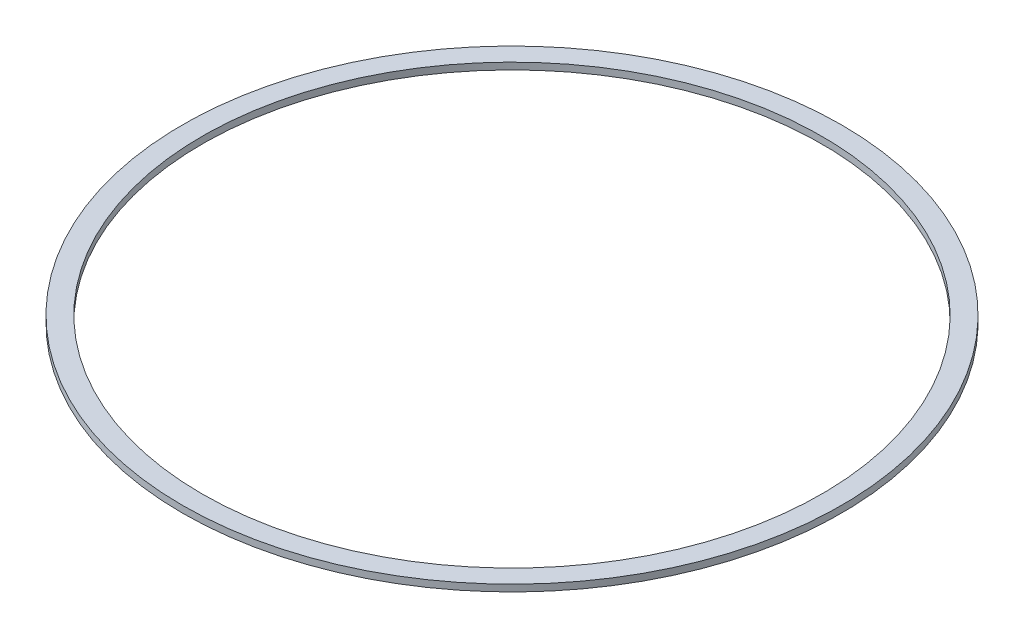
ISO-10303-21;
HEADER;
FILE_DESCRIPTION(('STEP AP214'),'2;1');
FILE_NAME('part.step','',(''),(''),'','','');
FILE_SCHEMA(('AUTOMOTIVE_DESIGN { 1 0 10303 214 1 1 1 1 }'));
ENDSEC;
DATA;
#1=APPLICATION_CONTEXT('core data for automotive mechanical design processes');
#2=APPLICATION_PROTOCOL_DEFINITION('international standard','automotive_design',2000,#1);
#3=PRODUCT_CONTEXT('',#1,'mechanical');
#4=PRODUCT('Part','Part','',(#3));
#5=PRODUCT_RELATED_PRODUCT_CATEGORY('part','',(#4));
#6=PRODUCT_DEFINITION_FORMATION('','',#4);
#7=PRODUCT_DEFINITION_CONTEXT('part definition',#1,'design');
#8=PRODUCT_DEFINITION('design','',#6,#7);
#9=PRODUCT_DEFINITION_SHAPE('','',#8);
#10=(LENGTH_UNIT() NAMED_UNIT(*) SI_UNIT(.MILLI.,.METRE.));
#11=(NAMED_UNIT(*) PLANE_ANGLE_UNIT() SI_UNIT($,.RADIAN.));
#12=(NAMED_UNIT(*) SI_UNIT($,.STERADIAN.) SOLID_ANGLE_UNIT());
#13=UNCERTAINTY_MEASURE_WITH_UNIT(LENGTH_MEASURE(1.E-05),#10,'distance_accuracy_value','');
#14=(GEOMETRIC_REPRESENTATION_CONTEXT(3) GLOBAL_UNCERTAINTY_ASSIGNED_CONTEXT((#13)) GLOBAL_UNIT_ASSIGNED_CONTEXT((#10,
#11,#12)) REPRESENTATION_CONTEXT('',''));
#15=CARTESIAN_POINT('',(0.,0.,0.));
#16=DIRECTION('',(0.,0.,1.));
#17=DIRECTION('',(1.,0.,0.));
#18=AXIS2_PLACEMENT_3D('',#15,#16,#17);
#19=CARTESIAN_POINT('',(0.,0.6,0.));
#20=DIRECTION('',(0.,1.,0.));
#21=DIRECTION('',(0.,0.,1.));
#22=AXIS2_PLACEMENT_3D('',#19,#20,#21);
#23=PLANE('',#22);
#24=CARTESIAN_POINT('',(0.,0.6,0.));
#25=DIRECTION('',(0.,1.,0.));
#26=DIRECTION('',(0.,0.,1.));
#27=AXIS2_PLACEMENT_3D('',#24,#25,#26);
#28=CIRCLE('',#27,29.25);
#29=CARTESIAN_POINT('',(0.,0.6,29.25));
#30=VERTEX_POINT('',#29);
#31=EDGE_CURVE('E10',#30,#30,#28,.T.);
#32=ORIENTED_EDGE('',*,*,#31,.T.);
#33=EDGE_LOOP('',(#32));
#34=FACE_BOUND('',#33,.T.);
#35=CARTESIAN_POINT('',(0.,0.6,0.));
#36=DIRECTION('',(0.,1.,0.));
#37=DIRECTION('',(0.,0.,1.));
#38=AXIS2_PLACEMENT_3D('',#35,#36,#37);
#39=CIRCLE('',#38,27.5);
#40=CARTESIAN_POINT('',(0.,0.6,27.5));
#41=VERTEX_POINT('',#40);
#42=EDGE_CURVE('E41',#41,#41,#39,.T.);
#43=ORIENTED_EDGE('',*,*,#42,.F.);
#44=EDGE_LOOP('',(#43));
#45=FACE_BOUND('',#44,.T.);
#46=ADVANCED_FACE('F30',(#34,#45),#23,.T.);
#47=CARTESIAN_POINT('',(0.,0.,0.));
#48=DIRECTION('',(0.,1.,0.));
#49=DIRECTION('',(0.,0.,1.));
#50=AXIS2_PLACEMENT_3D('',#47,#48,#49);
#51=PLANE('',#50);
#52=CARTESIAN_POINT('',(0.,0.,0.));
#53=DIRECTION('',(0.,1.,0.));
#54=DIRECTION('',(0.,0.,1.));
#55=AXIS2_PLACEMENT_3D('',#52,#53,#54);
#56=CIRCLE('',#55,29.25);
#57=CARTESIAN_POINT('',(0.,0.,29.25));
#58=VERTEX_POINT('',#57);
#59=EDGE_CURVE('E34',#58,#58,#56,.T.);
#60=ORIENTED_EDGE('',*,*,#59,.F.);
#61=EDGE_LOOP('',(#60));
#62=FACE_BOUND('',#61,.T.);
#63=CARTESIAN_POINT('',(0.,0.,0.));
#64=DIRECTION('',(0.,1.,0.));
#65=DIRECTION('',(0.,0.,1.));
#66=AXIS2_PLACEMENT_3D('',#63,#64,#65);
#67=CIRCLE('',#66,27.5);
#68=CARTESIAN_POINT('',(0.,0.,27.5));
#69=VERTEX_POINT('',#68);
#70=EDGE_CURVE('E43',#69,#69,#67,.T.);
#71=ORIENTED_EDGE('',*,*,#70,.T.);
#72=EDGE_LOOP('',(#71));
#73=FACE_BOUND('',#72,.T.);
#74=ADVANCED_FACE('F53',(#62,#73),#51,.F.);
#75=CARTESIAN_POINT('',(0.,0.6,0.));
#76=DIRECTION('',(0.,-1.,0.));
#77=DIRECTION('',(0.,0.,-1.));
#78=AXIS2_PLACEMENT_3D('',#75,#76,#77);
#79=CYLINDRICAL_SURFACE('',#78,29.25);
#80=ORIENTED_EDGE('',*,*,#31,.F.);
#81=EDGE_LOOP('',(#80));
#82=FACE_BOUND('',#81,.T.);
#83=ORIENTED_EDGE('',*,*,#59,.T.);
#84=EDGE_LOOP('',(#83));
#85=FACE_BOUND('',#84,.T.);
#86=ADVANCED_FACE('F32',(#82,#85),#79,.T.);
#87=CARTESIAN_POINT('',(0.,0.6,0.));
#88=DIRECTION('',(0.,-1.,0.));
#89=DIRECTION('',(0.,0.,-1.));
#90=AXIS2_PLACEMENT_3D('',#87,#88,#89);
#91=CYLINDRICAL_SURFACE('',#90,27.5);
#92=ORIENTED_EDGE('',*,*,#42,.T.);
#93=EDGE_LOOP('',(#92));
#94=FACE_BOUND('',#93,.T.);
#95=ORIENTED_EDGE('',*,*,#70,.F.);
#96=EDGE_LOOP('',(#95));
#97=FACE_BOUND('',#96,.T.);
#98=ADVANCED_FACE('F49',(#94,#97),#91,.F.);
#99=CLOSED_SHELL('',(#46,#74,#86,#98));
#100=MANIFOLD_SOLID_BREP('B2',#99);
#101=ADVANCED_BREP_SHAPE_REPRESENTATION('',(#18,#100),#14);
#102=SHAPE_DEFINITION_REPRESENTATION(#9,#101);
ENDSEC;
END-ISO-10303-21;
